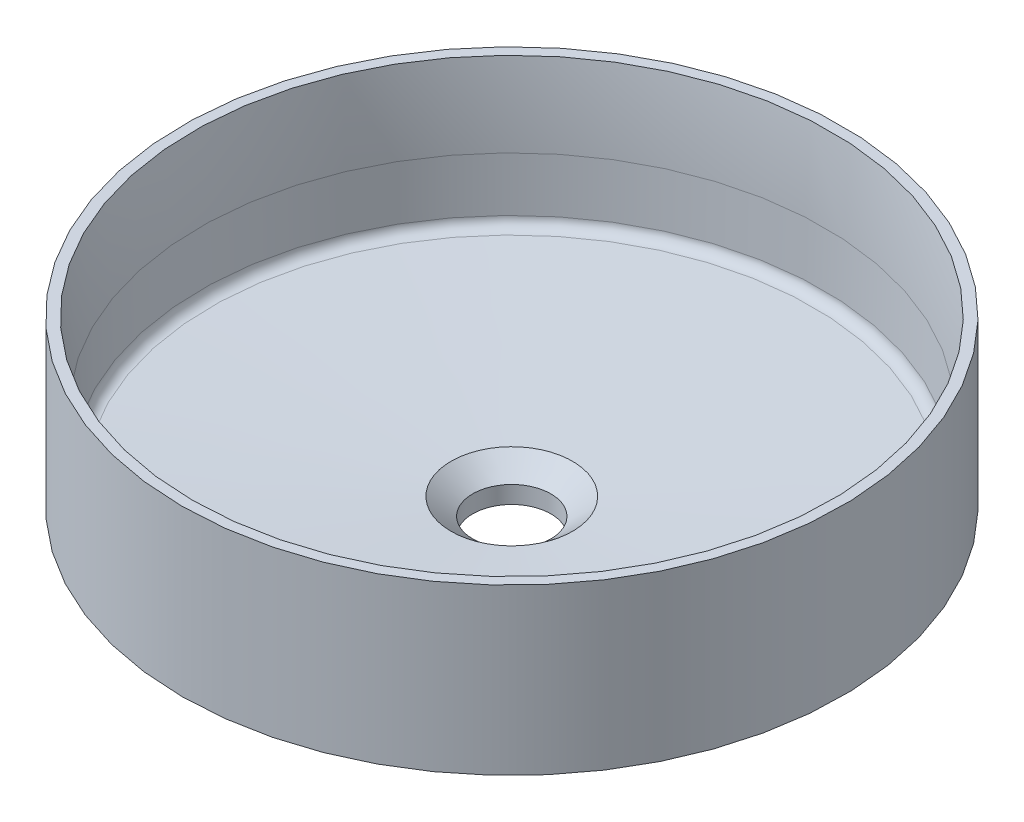
ISO-10303-21;
HEADER;
FILE_DESCRIPTION(('STEP AP214'),'2;1');
FILE_NAME('part.step','',(''),(''),'','','');
FILE_SCHEMA(('AUTOMOTIVE_DESIGN { 1 0 10303 214 1 1 1 1 }'));
ENDSEC;
DATA;
#1=APPLICATION_CONTEXT('core data for automotive mechanical design processes');
#2=APPLICATION_PROTOCOL_DEFINITION('international standard','automotive_design',2000,#1);
#3=PRODUCT_CONTEXT('',#1,'mechanical');
#4=PRODUCT('Part','Part','',(#3));
#5=PRODUCT_RELATED_PRODUCT_CATEGORY('part','',(#4));
#6=PRODUCT_DEFINITION_FORMATION('','',#4);
#7=PRODUCT_DEFINITION_CONTEXT('part definition',#1,'design');
#8=PRODUCT_DEFINITION('design','',#6,#7);
#9=PRODUCT_DEFINITION_SHAPE('','',#8);
#10=(LENGTH_UNIT() NAMED_UNIT(*) SI_UNIT(.MILLI.,.METRE.));
#11=(NAMED_UNIT(*) PLANE_ANGLE_UNIT() SI_UNIT($,.RADIAN.));
#12=(NAMED_UNIT(*) SI_UNIT($,.STERADIAN.) SOLID_ANGLE_UNIT());
#13=UNCERTAINTY_MEASURE_WITH_UNIT(LENGTH_MEASURE(1.E-05),#10,'distance_accuracy_value','');
#14=(GEOMETRIC_REPRESENTATION_CONTEXT(3) GLOBAL_UNCERTAINTY_ASSIGNED_CONTEXT((#13)) GLOBAL_UNIT_ASSIGNED_CONTEXT((#10,
#11,#12)) REPRESENTATION_CONTEXT('',''));
#15=CARTESIAN_POINT('',(0.,0.,0.));
#16=DIRECTION('',(0.,0.,1.));
#17=DIRECTION('',(1.,0.,0.));
#18=AXIS2_PLACEMENT_3D('',#15,#16,#17);
#19=CARTESIAN_POINT('',(0.,-110.,0.));
#20=DIRECTION('',(0.,-1.,0.));
#21=DIRECTION('',(0.,0.,-1.));
#22=AXIS2_PLACEMENT_3D('',#19,#20,#21);
#23=PLANE('',#22);
#24=CARTESIAN_POINT('',(0.,-110.,0.));
#25=DIRECTION('',(0.,1.,0.));
#26=DIRECTION('',(0.,0.,1.));
#27=AXIS2_PLACEMENT_3D('',#24,#25,#26);
#28=CIRCLE('',#27,55.);
#29=CARTESIAN_POINT('',(0.,-110.,55.));
#30=VERTEX_POINT('',#29);
#31=EDGE_CURVE('E93',#30,#30,#28,.T.);
#32=ORIENTED_EDGE('',*,*,#31,.F.);
#33=EDGE_LOOP('',(#32));
#34=FACE_BOUND('',#33,.T.);
#35=CARTESIAN_POINT('',(0.,-110.,0.));
#36=DIRECTION('',(0.,1.,0.));
#37=DIRECTION('',(0.,0.,1.));
#38=AXIS2_PLACEMENT_3D('',#35,#36,#37);
#39=CIRCLE('',#38,22.5);
#40=CARTESIAN_POINT('',(0.,-110.,22.5));
#41=VERTEX_POINT('',#40);
#42=EDGE_CURVE('E81',#41,#41,#39,.T.);
#43=ORIENTED_EDGE('',*,*,#42,.T.);
#44=EDGE_LOOP('',(#43));
#45=FACE_BOUND('',#44,.T.);
#46=ADVANCED_FACE('F37',(#34,#45),#23,.T.);
#47=CARTESIAN_POINT('',(0.,-95.,0.));
#48=DIRECTION('',(0.,1.,0.));
#49=DIRECTION('',(0.,0.,1.));
#50=AXIS2_PLACEMENT_3D('',#47,#48,#49);
#51=CYLINDRICAL_SURFACE('',#50,190.);
#52=CARTESIAN_POINT('',(0.,-95.,0.));
#53=DIRECTION('',(0.,1.,0.));
#54=DIRECTION('',(0.,0.,1.));
#55=AXIS2_PLACEMENT_3D('',#52,#53,#54);
#56=CIRCLE('',#55,190.);
#57=CARTESIAN_POINT('',(0.,-95.,190.));
#58=VERTEX_POINT('',#57);
#59=EDGE_CURVE('E75',#58,#58,#56,.T.);
#60=ORIENTED_EDGE('',*,*,#59,.T.);
#61=EDGE_LOOP('',(#60));
#62=FACE_BOUND('',#61,.T.);
#63=CARTESIAN_POINT('',(0.,0.,0.));
#64=DIRECTION('',(0.,1.,0.));
#65=DIRECTION('',(0.,0.,1.));
#66=AXIS2_PLACEMENT_3D('',#63,#64,#65);
#67=CIRCLE('',#66,190.);
#68=CARTESIAN_POINT('',(0.,0.,190.));
#69=VERTEX_POINT('',#68);
#70=EDGE_CURVE('E69',#69,#69,#67,.T.);
#71=ORIENTED_EDGE('',*,*,#70,.F.);
#72=EDGE_LOOP('',(#71));
#73=FACE_BOUND('',#72,.T.);
#74=ADVANCED_FACE('F119',(#62,#73),#51,.T.);
#75=CARTESIAN_POINT('',(0.,0.,0.));
#76=DIRECTION('',(0.,1.,0.));
#77=DIRECTION('',(0.,0.,1.));
#78=AXIS2_PLACEMENT_3D('',#75,#76,#77);
#79=PLANE('',#78);
#80=CARTESIAN_POINT('',(0.,0.,0.));
#81=DIRECTION('',(0.,1.,0.));
#82=DIRECTION('',(0.,0.,1.));
#83=AXIS2_PLACEMENT_3D('',#80,#81,#82);
#84=CIRCLE('',#83,184.);
#85=CARTESIAN_POINT('',(0.,0.,184.));
#86=VERTEX_POINT('',#85);
#87=EDGE_CURVE('E78',#86,#86,#84,.T.);
#88=ORIENTED_EDGE('',*,*,#87,.F.);
#89=EDGE_LOOP('',(#88));
#90=FACE_BOUND('',#89,.T.);
#91=ORIENTED_EDGE('',*,*,#70,.T.);
#92=EDGE_LOOP('',(#91));
#93=FACE_BOUND('',#92,.T.);
#94=ADVANCED_FACE('F125',(#90,#93),#79,.T.);
#95=CARTESIAN_POINT('',(0.,-97.,0.));
#96=DIRECTION('',(0.,1.,0.));
#97=DIRECTION('',(0.,0.,1.));
#98=AXIS2_PLACEMENT_3D('',#95,#96,#97);
#99=CONICAL_SURFACE('',#98,167.5,1.48214044492746);
#100=CARTESIAN_POINT('',(0.,-96.5949065734595,0.));
#101=DIRECTION('',(0.,-1.,0.));
#102=DIRECTION('',(0.,0.,-1.));
#103=AXIS2_PLACEMENT_3D('',#100,#101,#102);
#104=CIRCLE('',#103,172.057301048581);
#105=CARTESIAN_POINT('',(0.,-96.5949065734595,-172.057301048581));
#106=VERTEX_POINT('',#105);
#107=EDGE_CURVE('E63',#106,#106,#104,.F.);
#108=ORIENTED_EDGE('',*,*,#107,.T.);
#109=EDGE_LOOP('',(#108));
#110=FACE_BOUND('',#109,.T.);
#111=ORIENTED_EDGE('',*,*,#59,.F.);
#112=EDGE_LOOP('',(#111));
#113=FACE_BOUND('',#112,.T.);
#114=ADVANCED_FACE('F134',(#110,#113),#99,.T.);
#115=CARTESIAN_POINT('',(0.,-110.,0.));
#116=DIRECTION('',(0.,1.,0.));
#117=DIRECTION('',(0.,0.,1.));
#118=AXIS2_PLACEMENT_3D('',#115,#116,#117);
#119=CIRCLE('',#118,157.5);
#120=CARTESIAN_POINT('',(0.,-110.,157.5));
#121=VERTEX_POINT('',#120);
#122=EDGE_CURVE('E96',#121,#121,#119,.T.);
#123=ORIENTED_EDGE('',*,*,#122,.T.);
#124=EDGE_LOOP('',(#123));
#125=FACE_BOUND('',#124,.T.);
#126=CARTESIAN_POINT('',(0.,-110.,0.));
#127=DIRECTION('',(0.,-1.,0.));
#128=DIRECTION('',(0.,0.,-1.));
#129=AXIS2_PLACEMENT_3D('',#126,#127,#128);
#130=CIRCLE('',#129,167.5);
#131=CARTESIAN_POINT('',(0.,-110.,-167.5));
#132=VERTEX_POINT('',#131);
#133=EDGE_CURVE('E72',#132,#132,#130,.T.);
#134=ORIENTED_EDGE('',*,*,#133,.T.);
#135=EDGE_LOOP('',(#134));
#136=FACE_BOUND('',#135,.T.);
#137=ADVANCED_FACE('F100',(#125,#136),#23,.T.);
#138=CARTESIAN_POINT('',(0.,-110.,0.));
#139=DIRECTION('',(0.,1.,0.));
#140=DIRECTION('',(0.,0.,1.));
#141=AXIS2_PLACEMENT_3D('',#138,#139,#140);
#142=CYLINDRICAL_SURFACE('',#141,167.5);
#143=CARTESIAN_POINT('',(0.,-101.575269776923,0.));
#144=DIRECTION('',(0.,-1.,0.));
#145=DIRECTION('',(0.,0.,-1.));
#146=AXIS2_PLACEMENT_3D('',#143,#144,#145);
#147=CIRCLE('',#146,167.5);
#148=CARTESIAN_POINT('',(0.,-101.575269776923,-167.5));
#149=VERTEX_POINT('',#148);
#150=EDGE_CURVE('E66',#149,#149,#147,.T.);
#151=ORIENTED_EDGE('',*,*,#150,.T.);
#152=EDGE_LOOP('',(#151));
#153=FACE_BOUND('',#152,.T.);
#154=ORIENTED_EDGE('',*,*,#133,.F.);
#155=EDGE_LOOP('',(#154));
#156=FACE_BOUND('',#155,.T.);
#157=ADVANCED_FACE('F133',(#153,#156),#142,.T.);
#158=CARTESIAN_POINT('',(0.,-101.575269776923,0.));
#159=DIRECTION('',(0.,-1.,0.));
#160=DIRECTION('',(0.,0.,-1.));
#161=AXIS2_PLACEMENT_3D('',#158,#159,#160);
#162=TOROIDAL_SURFACE('',#161,172.5,5.);
#163=ORIENTED_EDGE('',*,*,#107,.F.);
#164=EDGE_LOOP('',(#163));
#165=FACE_BOUND('',#164,.T.);
#166=ORIENTED_EDGE('',*,*,#150,.F.);
#167=EDGE_LOOP('',(#166));
#168=FACE_BOUND('',#167,.T.);
#169=ADVANCED_FACE('F139',(#165,#168),#162,.F.);
#170=CARTESIAN_POINT('',(0.,-63.5059289607447,0.));
#171=DIRECTION('',(0.,1.,0.));
#172=DIRECTION('',(0.,0.,1.));
#173=AXIS2_PLACEMENT_3D('',#170,#171,#172);
#174=TOROIDAL_SURFACE('',#173,679.950599341137,500.);
#175=CARTESIAN_POINT('',(0.,-46.0561806094925,0.));
#176=DIRECTION('',(0.,1.,0.));
#177=DIRECTION('',(0.,0.,1.));
#178=AXIS2_PLACEMENT_3D('',#175,#176,#177);
#179=CIRCLE('',#178,180.255185831589);
#180=CARTESIAN_POINT('',(0.,-46.0561806094925,180.255185831589));
#181=VERTEX_POINT('',#180);
#182=EDGE_CURVE('E90',#181,#181,#179,.T.);
#183=ORIENTED_EDGE('',*,*,#182,.F.);
#184=EDGE_LOOP('',(#183));
#185=FACE_BOUND('',#184,.T.);
#186=ORIENTED_EDGE('',*,*,#87,.T.);
#187=EDGE_LOOP('',(#186));
#188=FACE_BOUND('',#187,.T.);
#189=ADVANCED_FACE('F149',(#185,#188),#174,.T.);
#190=CARTESIAN_POINT('',(0.,0.,0.));
#191=DIRECTION('',(0.,1.,0.));
#192=DIRECTION('',(0.,0.,1.));
#193=AXIS2_PLACEMENT_3D('',#190,#191,#192);
#194=CYLINDRICAL_SURFACE('',#193,22.5);
#195=ORIENTED_EDGE('',*,*,#42,.F.);
#196=EDGE_LOOP('',(#195));
#197=FACE_BOUND('',#196,.T.);
#198=CARTESIAN_POINT('',(0.,-100.,0.));
#199=DIRECTION('',(0.,1.,0.));
#200=DIRECTION('',(0.,0.,1.));
#201=AXIS2_PLACEMENT_3D('',#198,#199,#200);
#202=CIRCLE('',#201,22.5);
#203=CARTESIAN_POINT('',(0.,-100.,22.5));
#204=VERTEX_POINT('',#203);
#205=EDGE_CURVE('E84',#204,#204,#202,.T.);
#206=ORIENTED_EDGE('',*,*,#205,.T.);
#207=EDGE_LOOP('',(#206));
#208=FACE_BOUND('',#207,.T.);
#209=ADVANCED_FACE('F152',(#197,#208),#194,.F.);
#210=CARTESIAN_POINT('',(0.,-90.,0.));
#211=DIRECTION('',(0.,1.,0.));
#212=DIRECTION('',(0.,0.,1.));
#213=AXIS2_PLACEMENT_3D('',#210,#211,#212);
#214=CONICAL_SURFACE('',#213,35.,0.896055384571344);
#215=ORIENTED_EDGE('',*,*,#205,.F.);
#216=EDGE_LOOP('',(#215));
#217=FACE_BOUND('',#216,.T.);
#218=CARTESIAN_POINT('',(0.,-90.,0.));
#219=DIRECTION('',(0.,1.,0.));
#220=DIRECTION('',(0.,0.,1.));
#221=AXIS2_PLACEMENT_3D('',#218,#219,#220);
#222=CIRCLE('',#221,35.);
#223=CARTESIAN_POINT('',(0.,-90.,34.9999999999999));
#224=VERTEX_POINT('',#223);
#225=EDGE_CURVE('E87',#224,#224,#222,.T.);
#226=ORIENTED_EDGE('',*,*,#225,.T.);
#227=EDGE_LOOP('',(#226));
#228=FACE_BOUND('',#227,.T.);
#229=ADVANCED_FACE('F156',(#217,#228),#214,.F.);
#230=CARTESIAN_POINT('',(0.,-82.,0.));
#231=DIRECTION('',(0.,1.,0.));
#232=DIRECTION('',(0.,0.,1.));
#233=AXIS2_PLACEMENT_3D('',#230,#231,#232);
#234=CONICAL_SURFACE('',#233,179.,1.51529782154918);
#235=CARTESIAN_POINT('',(0.,-82.3040139737179,0.));
#236=DIRECTION('',(0.,1.,0.));
#237=DIRECTION('',(0.,0.,1.));
#238=AXIS2_PLACEMENT_3D('',#235,#236,#237);
#239=CIRCLE('',#238,173.527748473089);
#240=CARTESIAN_POINT('',(0.,-82.3040139737179,173.527748473078));
#241=VERTEX_POINT('',#240);
#242=EDGE_CURVE('E60',#241,#241,#239,.T.);
#243=CARTESIAN_POINT('',(0.,-82.3040139737179,173.527748473078));
#244=CARTESIAN_POINT('',(0.,-82.384180494825,172.08475109315));
#245=CARTESIAN_POINT('',(0.,-82.4643470159321,170.641753713223));
#246=CARTESIAN_POINT('',(0.,-82.6246800581463,167.755758953367));
#247=CARTESIAN_POINT('',(0.,-82.7048465792534,166.312761573439));
#248=CARTESIAN_POINT('',(0.,-82.8651796214676,163.426766813583));
#249=CARTESIAN_POINT('',(0.,-82.9453461425747,161.983769433655));
#250=CARTESIAN_POINT('',(0.,-83.105679184789,159.097774673799));
#251=CARTESIAN_POINT('',(0.,-83.1858457058961,157.654777293871));
#252=CARTESIAN_POINT('',(0.,-83.3461787481103,154.768782534016));
#253=CARTESIAN_POINT('',(0.,-83.4263452692174,153.325785154088));
#254=CARTESIAN_POINT('',(0.,-83.5866783114316,150.439790394232));
#255=CARTESIAN_POINT('',(0.,-83.6668448325387,148.996793014304));
#256=CARTESIAN_POINT('',(0.,-83.8271778747529,146.110798254448));
#257=CARTESIAN_POINT('',(0.,-83.90734439586,144.66780087452));
#258=CARTESIAN_POINT('',(0.,-84.0676774380742,141.781806114665));
#259=CARTESIAN_POINT('',(0.,-84.1478439591813,140.338808734737));
#260=CARTESIAN_POINT('',(0.,-84.3081770013955,137.452813974881));
#261=CARTESIAN_POINT('',(0.,-84.3883435225026,136.009816594953));
#262=CARTESIAN_POINT('',(0.,-84.5486765647169,133.123821835097));
#263=CARTESIAN_POINT('',(0.,-84.628843085824,131.680824455169));
#264=CARTESIAN_POINT('',(0.,-84.7891761280382,128.794829695313));
#265=CARTESIAN_POINT('',(0.,-84.8693426491453,127.351832315386));
#266=CARTESIAN_POINT('',(0.,-85.0296756913595,124.46583755553));
#267=CARTESIAN_POINT('',(0.,-85.1098422124666,123.022840175602));
#268=CARTESIAN_POINT('',(0.,-85.2701752546808,120.136845415746));
#269=CARTESIAN_POINT('',(0.,-85.3503417757879,118.693848035818));
#270=CARTESIAN_POINT('',(0.,-85.5106748180021,115.807853275962));
#271=CARTESIAN_POINT('',(0.,-85.5908413391092,114.364855896034));
#272=CARTESIAN_POINT('',(0.,-85.7511743813234,111.478861136179));
#273=CARTESIAN_POINT('',(0.,-85.8313409024305,110.035863756251));
#274=CARTESIAN_POINT('',(0.,-85.9916739446448,107.149868996395));
#275=CARTESIAN_POINT('',(0.,-86.0718404657518,105.706871616467));
#276=CARTESIAN_POINT('',(0.,-86.2321735079661,102.820876856611));
#277=CARTESIAN_POINT('',(0.,-86.3123400290732,101.377879476683));
#278=CARTESIAN_POINT('',(0.,-86.4726730712874,98.4918847168275));
#279=CARTESIAN_POINT('',(0.,-86.5528395923945,97.0488873368996));
#280=CARTESIAN_POINT('',(0.,-86.7131726346087,94.1628925770438));
#281=CARTESIAN_POINT('',(0.,-86.7933391557158,92.7198951971159));
#282=CARTESIAN_POINT('',(0.,-86.95367219793,89.8339004372601));
#283=CARTESIAN_POINT('',(0.,-87.0338387190371,88.3909030573322));
#284=CARTESIAN_POINT('',(0.,-87.1941717612513,85.5049082974764));
#285=CARTESIAN_POINT('',(0.,-87.2743382823584,84.0619109175485));
#286=CARTESIAN_POINT('',(0.,-87.4346713245726,81.1759161576927));
#287=CARTESIAN_POINT('',(0.,-87.5148378456798,79.7329187777648));
#288=CARTESIAN_POINT('',(0.,-87.675170887894,76.846924017909));
#289=CARTESIAN_POINT('',(0.,-87.7553374090011,75.4039266379811));
#290=CARTESIAN_POINT('',(0.,-87.9156704512153,72.5179318781253));
#291=CARTESIAN_POINT('',(0.,-87.9958369723224,71.0749344981974));
#292=CARTESIAN_POINT('',(0.,-88.1561700145366,68.1889397383416));
#293=CARTESIAN_POINT('',(0.,-88.2363365356437,66.7459423584137));
#294=CARTESIAN_POINT('',(0.,-88.3966695778579,63.8599475985579));
#295=CARTESIAN_POINT('',(0.,-88.476836098965,62.41695021863));
#296=CARTESIAN_POINT('',(0.,-88.6371691411792,59.5309554587742));
#297=CARTESIAN_POINT('',(0.,-88.7173356622863,58.0879580788463));
#298=CARTESIAN_POINT('',(0.,-88.8776687045006,55.2019633189905));
#299=CARTESIAN_POINT('',(0.,-88.9578352256076,53.7589659390626));
#300=CARTESIAN_POINT('',(0.,-89.1181682678219,50.8729711792068));
#301=CARTESIAN_POINT('',(0.,-89.198334788929,49.4299737992789));
#302=CARTESIAN_POINT('',(0.,-89.3586678311432,46.5439790394231));
#303=CARTESIAN_POINT('',(0.,-89.4388343522503,45.1009816594952));
#304=CARTESIAN_POINT('',(0.,-89.5991673944645,42.2149868996394));
#305=CARTESIAN_POINT('',(0.,-89.6793339155716,40.7719895197115));
#306=CARTESIAN_POINT('',(0.,-89.8396669577858,37.8859947598557));
#307=CARTESIAN_POINT('',(0.,-89.9198334788929,36.4429973799278));
#308=CARTESIAN_POINT('',(0.,-90.,34.9999999999999));
#309=B_SPLINE_CURVE_WITH_KNOTS('',3,(#243,#244,#245,#246,#247,#248,#249,#250,#251,#252,#253,
#254,#255,#256,#257,#258,#259,#260,#261,#262,#263,#264,#265,#266,#267,#268,#269,#270,#271,#272,
#273,#274,#275,#276,#277,#278,#279,#280,#281,#282,#283,#284,#285,#286,#287,#288,#289,#290,#291,
#292,#293,#294,#295,#296,#297,#298,#299,#300,#301,#302,#303,#304,#305,#306,#307,#308),
.UNSPECIFIED.,.F.,.F.,(4,2,2,2,2,2,2,2,2,2,2,2,2,2,2,2,2,2,2,2,2,2,2,2,2,2,2,2,2,2,2,2,4),(0.,
4.33566753640852,8.67133507281706,13.0070026092256,17.3426701456341,21.6783376820426,
26.0140052184512,30.3496727548597,34.6853402912682,39.0210078276768,43.3566753640853,
47.6923429004938,52.0280104369023,56.3636779733109,60.6993455097194,65.0350130461279,
69.3706805825365,73.706348118945,78.0420156553535,82.377683191762,86.7133507281706,
91.0490182645791,95.3846858009876,99.7203533373961,104.056020873805,108.391688410213,
112.727355946622,117.06302348303,121.398691019439,125.734358555847,130.070026092256,
134.405693628664,138.741361165073),.UNSPECIFIED.);
#310=EDGE_CURVE('BSEAM160',#241,#224,#309,.T.);
#311=ORIENTED_EDGE('',*,*,#242,.T.);
#312=ORIENTED_EDGE('',*,*,#225,.F.);
#313=ORIENTED_EDGE('',*,*,#310,.T.);
#314=ORIENTED_EDGE('',*,*,#310,.F.);
#315=EDGE_LOOP('',(#311,#313,#312,#314));
#316=FACE_BOUND('',#315,.T.);
#317=ADVANCED_FACE('F160',(#316),#234,.F.);
#318=CARTESIAN_POINT('',(0.,-46.0561806094925,0.));
#319=DIRECTION('',(0.,1.,0.));
#320=DIRECTION('',(0.,0.,1.));
#321=AXIS2_PLACEMENT_3D('',#318,#319,#320);
#322=CONICAL_SURFACE('',#321,180.255185831589,0.0349065850398905);
#323=CARTESIAN_POINT('',(0.,-76.5226488346998,0.));
#324=DIRECTION('',(0.,1.,0.));
#325=DIRECTION('',(0.,0.,1.));
#326=AXIS2_PLACEMENT_3D('',#323,#324,#325);
#327=CIRCLE('',#326,179.191273317469);
#328=CARTESIAN_POINT('',(0.,-76.5226488346998,179.191273317469));
#329=VERTEX_POINT('',#328);
#330=EDGE_CURVE('E57',#329,#329,#327,.F.);
#331=ORIENTED_EDGE('',*,*,#330,.T.);
#332=EDGE_LOOP('',(#331));
#333=FACE_BOUND('',#332,.T.);
#334=ORIENTED_EDGE('',*,*,#182,.T.);
#335=EDGE_LOOP('',(#334));
#336=FACE_BOUND('',#335,.T.);
#337=ADVANCED_FACE('F164',(#333,#336),#322,.F.);
#338=CARTESIAN_POINT('',(0.,0.,0.));
#339=DIRECTION('',(0.,1.,0.));
#340=DIRECTION('',(0.,0.,1.));
#341=AXIS2_PLACEMENT_3D('',#338,#339,#340);
#342=CYLINDRICAL_SURFACE('',#341,55.);
#343=CARTESIAN_POINT('',(0.,-108.364173752578,0.));
#344=DIRECTION('',(0.,1.,0.));
#345=DIRECTION('',(0.,0.,1.));
#346=AXIS2_PLACEMENT_3D('',#343,#344,#345);
#347=CIRCLE('',#346,55.);
#348=CARTESIAN_POINT('',(0.,-108.364173752578,55.));
#349=VERTEX_POINT('',#348);
#350=EDGE_CURVE('E44',#349,#349,#347,.F.);
#351=ORIENTED_EDGE('',*,*,#350,.T.);
#352=EDGE_LOOP('',(#351));
#353=FACE_BOUND('',#352,.T.);
#354=ORIENTED_EDGE('',*,*,#31,.T.);
#355=EDGE_LOOP('',(#354));
#356=FACE_BOUND('',#355,.T.);
#357=ADVANCED_FACE('F115',(#353,#356),#342,.T.);
#358=CARTESIAN_POINT('',(0.,-98.9043090985111,0.));
#359=DIRECTION('',(0.,1.,0.));
#360=DIRECTION('',(0.,0.,1.));
#361=AXIS2_PLACEMENT_3D('',#358,#359,#360);
#362=CONICAL_SURFACE('',#361,55.,1.51529782154918);
#363=CARTESIAN_POINT('',(0.,-98.3795702205237,0.));
#364=DIRECTION('',(0.,1.,0.));
#365=DIRECTION('',(0.,0.,1.));
#366=AXIS2_PLACEMENT_3D('',#363,#364,#365);
#367=CIRCLE('',#366,64.4452998037748);
#368=CARTESIAN_POINT('',(0.,-98.3795702205237,64.4452998037748));
#369=VERTEX_POINT('',#368);
#370=EDGE_CURVE('E48',#369,#369,#367,.T.);
#371=ORIENTED_EDGE('',*,*,#370,.T.);
#372=EDGE_LOOP('',(#371));
#373=FACE_BOUND('',#372,.T.);
#374=CARTESIAN_POINT('',(0.,-93.8178027111438,0.));
#375=DIRECTION('',(0.,1.,0.));
#376=DIRECTION('',(0.,0.,1.));
#377=AXIS2_PLACEMENT_3D('',#374,#375,#376);
#378=CIRCLE('',#377,146.55711497261);
#379=CARTESIAN_POINT('',(0.,-93.8178027111438,146.55711497261));
#380=VERTEX_POINT('',#379);
#381=EDGE_CURVE('E52',#380,#380,#378,.F.);
#382=ORIENTED_EDGE('',*,*,#381,.T.);
#383=EDGE_LOOP('',(#382));
#384=FACE_BOUND('',#383,.T.);
#385=ADVANCED_FACE('F106',(#373,#384),#362,.T.);
#386=CARTESIAN_POINT('',(0.,-93.2654202096222,0.));
#387=DIRECTION('',(0.,-1.,0.));
#388=DIRECTION('',(0.,0.,-1.));
#389=AXIS2_PLACEMENT_3D('',#386,#387,#388);
#390=CONICAL_SURFACE('',#389,156.5,0.0596855299770502);
#391=CARTESIAN_POINT('',(0.,-103.205905249468,0.));
#392=DIRECTION('',(0.,-1.,0.));
#393=DIRECTION('',(0.,0.,-1.));
#394=AXIS2_PLACEMENT_3D('',#391,#392,#393);
#395=CIRCLE('',#394,157.094008643441);
#396=CARTESIAN_POINT('',(0.,-103.205905249468,-157.094008643441));
#397=VERTEX_POINT('',#396);
#398=EDGE_CURVE('E11',#397,#397,#395,.F.);
#399=ORIENTED_EDGE('',*,*,#398,.T.);
#400=EDGE_LOOP('',(#399));
#401=FACE_BOUND('',#400,.T.);
#402=ORIENTED_EDGE('',*,*,#122,.F.);
#403=EDGE_LOOP('',(#402));
#404=FACE_BOUND('',#403,.T.);
#405=ADVANCED_FACE('F103',(#401,#404),#390,.F.);
#406=CARTESIAN_POINT('',(0.,-76.3132518544848,0.));
#407=DIRECTION('',(0.,1.,0.));
#408=DIRECTION('',(0.,0.,1.));
#409=AXIS2_PLACEMENT_3D('',#406,#407,#408);
#410=TOROIDAL_SURFACE('',#409,173.194928355354,6.);
#411=ORIENTED_EDGE('',*,*,#330,.F.);
#412=EDGE_LOOP('',(#411));
#413=FACE_BOUND('',#412,.T.);
#414=ORIENTED_EDGE('',*,*,#242,.F.);
#415=EDGE_LOOP('',(#414));
#416=FACE_BOUND('',#415,.T.);
#417=ADVANCED_FACE('F105',(#413,#416),#410,.F.);
#418=CARTESIAN_POINT('',(0.,-108.364173752578,0.));
#419=DIRECTION('',(0.,1.,0.));
#420=DIRECTION('',(0.,0.,1.));
#421=AXIS2_PLACEMENT_3D('',#418,#419,#420);
#422=TOROIDAL_SURFACE('',#421,65.,10.);
#423=ORIENTED_EDGE('',*,*,#350,.F.);
#424=EDGE_LOOP('',(#423));
#425=FACE_BOUND('',#424,.T.);
#426=ORIENTED_EDGE('',*,*,#370,.F.);
#427=EDGE_LOOP('',(#426));
#428=FACE_BOUND('',#427,.T.);
#429=ADVANCED_FACE('F112',(#425,#428),#422,.F.);
#430=CARTESIAN_POINT('',(0.,-103.802406243198,0.));
#431=DIRECTION('',(0.,1.,0.));
#432=DIRECTION('',(0.,0.,1.));
#433=AXIS2_PLACEMENT_3D('',#430,#431,#432);
#434=TOROIDAL_SURFACE('',#433,147.111815168835,10.);
#435=ORIENTED_EDGE('',*,*,#381,.F.);
#436=EDGE_LOOP('',(#435));
#437=FACE_BOUND('',#436,.T.);
#438=ORIENTED_EDGE('',*,*,#398,.F.);
#439=EDGE_LOOP('',(#438));
#440=FACE_BOUND('',#439,.T.);
#441=ADVANCED_FACE('F39',(#437,#440),#434,.F.);
#442=CLOSED_SHELL('',(#46,#74,#94,#114,#137,#157,#169,#189,#209,#229,#317,#337,#357,#385,#405,
#417,#429,#441));
#443=MANIFOLD_SOLID_BREP('B2',#442);
#444=ADVANCED_BREP_SHAPE_REPRESENTATION('',(#18,#443),#14);
#445=SHAPE_DEFINITION_REPRESENTATION(#9,#444);
ENDSEC;
END-ISO-10303-21;
